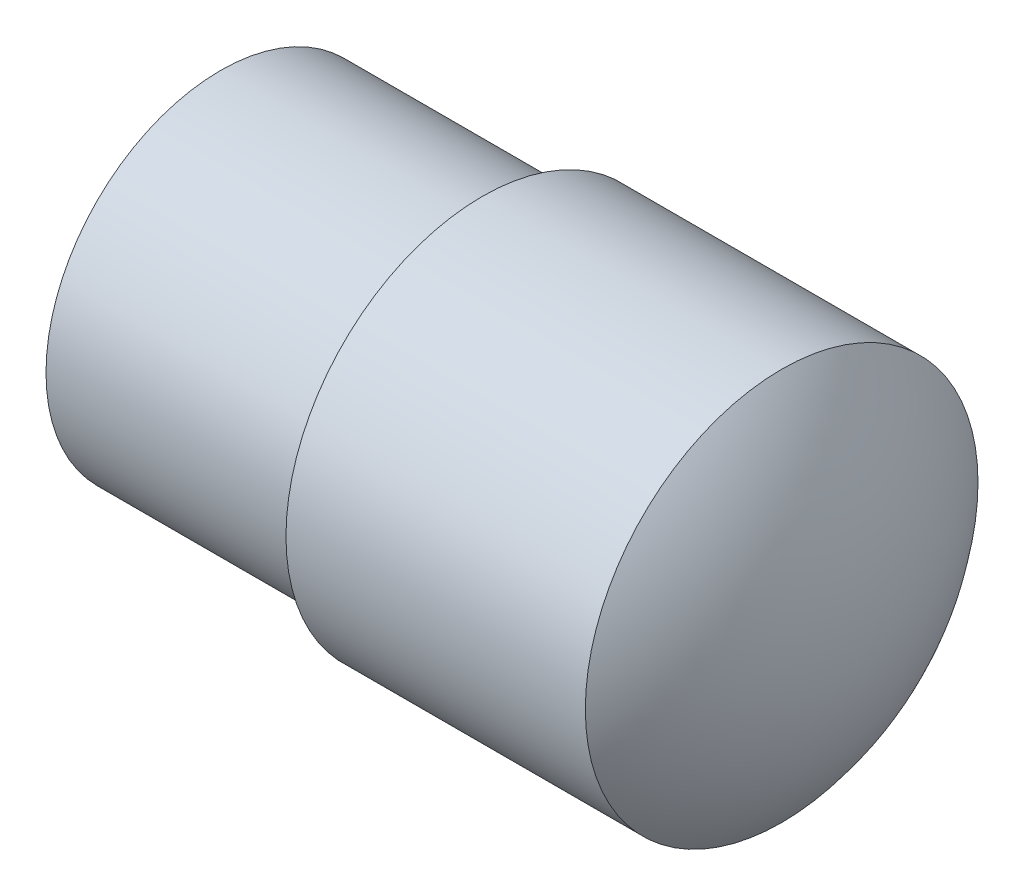
ISO-10303-21;
HEADER;
FILE_DESCRIPTION(('STEP AP214'),'2;1');
FILE_NAME('part.step','',(''),(''),'','','');
FILE_SCHEMA(('AUTOMOTIVE_DESIGN { 1 0 10303 214 1 1 1 1 }'));
ENDSEC;
DATA;
#1=APPLICATION_CONTEXT('core data for automotive mechanical design processes');
#2=APPLICATION_PROTOCOL_DEFINITION('international standard','automotive_design',2000,#1);
#3=PRODUCT_CONTEXT('',#1,'mechanical');
#4=PRODUCT('Part','Part','',(#3));
#5=PRODUCT_RELATED_PRODUCT_CATEGORY('part','',(#4));
#6=PRODUCT_DEFINITION_FORMATION('','',#4);
#7=PRODUCT_DEFINITION_CONTEXT('part definition',#1,'design');
#8=PRODUCT_DEFINITION('design','',#6,#7);
#9=PRODUCT_DEFINITION_SHAPE('','',#8);
#10=(LENGTH_UNIT() NAMED_UNIT(*) SI_UNIT(.MILLI.,.METRE.));
#11=(NAMED_UNIT(*) PLANE_ANGLE_UNIT() SI_UNIT($,.RADIAN.));
#12=(NAMED_UNIT(*) SI_UNIT($,.STERADIAN.) SOLID_ANGLE_UNIT());
#13=UNCERTAINTY_MEASURE_WITH_UNIT(LENGTH_MEASURE(1.E-05),#10,'distance_accuracy_value','');
#14=(GEOMETRIC_REPRESENTATION_CONTEXT(3) GLOBAL_UNCERTAINTY_ASSIGNED_CONTEXT((#13)) GLOBAL_UNIT_ASSIGNED_CONTEXT((#10,
#11,#12)) REPRESENTATION_CONTEXT('',''));
#15=CARTESIAN_POINT('',(0.,0.,0.));
#16=DIRECTION('',(0.,0.,1.));
#17=DIRECTION('',(1.,0.,0.));
#18=AXIS2_PLACEMENT_3D('',#15,#16,#17);
#19=CARTESIAN_POINT('',(-129.4123922426,0.,0.));
#20=DIRECTION('',(-1.,0.,0.));
#21=DIRECTION('',(0.,0.,1.));
#22=AXIS2_PLACEMENT_3D('',#19,#20,#21);
#23=CYLINDRICAL_SURFACE('',#22,9.00000000000001);
#24=CARTESIAN_POINT('',(-103.688586947836,0.,0.));
#25=DIRECTION('',(-1.,0.,0.));
#26=DIRECTION('',(0.,0.,1.));
#27=AXIS2_PLACEMENT_3D('',#24,#25,#26);
#28=CIRCLE('',#27,9.00000000000001);
#29=CARTESIAN_POINT('',(-103.688586947836,0.,9.00000000000001));
#30=VERTEX_POINT('',#29);
#31=EDGE_CURVE('E10',#30,#30,#28,.T.);
#32=ORIENTED_EDGE('',*,*,#31,.T.);
#33=EDGE_LOOP('',(#32));
#34=FACE_BOUND('',#33,.T.);
#35=CARTESIAN_POINT('',(-117.4123922426,0.,0.));
#36=DIRECTION('',(-1.,0.,0.));
#37=DIRECTION('',(0.,0.,1.));
#38=AXIS2_PLACEMENT_3D('',#35,#36,#37);
#39=CIRCLE('',#38,9.00000000000001);
#40=CARTESIAN_POINT('',(-117.4123922426,0.,9.00000000000001));
#41=VERTEX_POINT('',#40);
#42=EDGE_CURVE('E42',#41,#41,#39,.T.);
#43=ORIENTED_EDGE('',*,*,#42,.F.);
#44=EDGE_LOOP('',(#43));
#45=FACE_BOUND('',#44,.T.);
#46=CARTESIAN_POINT('',(-109.4123922426,-8.48528137423858,3.));
#47=CARTESIAN_POINT('',(-109.575796767108,-8.48528083591303,3.00000077384313));
#48=CARTESIAN_POINT('',(-109.739196642071,-8.49005307872573,2.98660435105656));
#49=CARTESIAN_POINT('',(-110.061155505583,-8.50852722243765,2.93355339506642));
#50=CARTESIAN_POINT('',(-110.219713692217,-8.52223059426567,2.89389453650519));
#51=CARTESIAN_POINT('',(-110.527272921592,-8.55684611066376,2.78986645705471));
#52=CARTESIAN_POINT('',(-110.676292030928,-8.57774411913966,2.72554566420973));
#53=CARTESIAN_POINT('',(-110.961472388244,-8.62437366030975,2.57418488532413));
#54=CARTESIAN_POINT('',(-111.097630790261,-8.65010625910838,2.48713988658054));
#55=CARTESIAN_POINT('',(-111.358552129615,-8.7046346822242,2.28915343932863));
#56=CARTESIAN_POINT('',(-111.482738528615,-8.73350684533933,2.17747302413375));
#57=CARTESIAN_POINT('',(-111.711012646274,-8.7904159440301,1.93496300164318));
#58=CARTESIAN_POINT('',(-111.815097137347,-8.81845274486886,1.80413032515712));
#59=CARTESIAN_POINT('',(-112.002828934589,-8.87141600765398,1.52281352389503));
#60=CARTESIAN_POINT('',(-112.085872154454,-8.89624223104817,1.37190573367357));
#61=CARTESIAN_POINT('',(-112.225166997982,-8.93908760312949,1.05729366896242));
#62=CARTESIAN_POINT('',(-112.28142584213,-8.95710858609007,0.89359285706163));
#63=CARTESIAN_POINT('',(-112.363599806497,-8.98377226295721,0.564086452300477));
#64=CARTESIAN_POINT('',(-112.390502581371,-8.99271944332678,0.398552264558902));
#65=CARTESIAN_POINT('',(-112.416341122682,-9.00130824654744,0.0650936244722683));
#66=CARTESIAN_POINT('',(-112.415284097557,-9.00095226788687,-0.102830200631688));
#67=CARTESIAN_POINT('',(-112.385859478902,-8.99118118856195,-0.429310545581442));
#68=CARTESIAN_POINT('',(-112.358564657176,-8.98212194265353,-0.587976145774968));
#69=CARTESIAN_POINT('',(-112.279213299658,-8.95640902019196,-0.898330316466513));
#70=CARTESIAN_POINT('',(-112.22715508566,-8.93975482893546,-1.05001841333765));
#71=CARTESIAN_POINT('',(-112.099128290682,-8.90027010879673,-1.34445742452592));
#72=CARTESIAN_POINT('',(-112.02285442696,-8.87736127572047,-1.48706466290654));
#73=CARTESIAN_POINT('',(-111.848813126254,-8.82775179116758,-1.75777297658197));
#74=CARTESIAN_POINT('',(-111.751039712617,-8.80105008604401,-1.88587000315602));
#75=CARTESIAN_POINT('',(-111.531369062221,-8.74518575549691,-2.13030259965392));
#76=CARTESIAN_POINT('',(-111.408552769075,-8.71596645506634,-2.24580047119581));
#77=CARTESIAN_POINT('',(-111.14504606542,-8.65942005746703,-2.45483177879452));
#78=CARTESIAN_POINT('',(-111.004352905416,-8.63209325236847,-2.54836182984463));
#79=CARTESIAN_POINT('',(-110.706431365789,-8.58211575363338,-2.71196236510723));
#80=CARTESIAN_POINT('',(-110.548995848646,-8.55953727854244,-2.78167939086402));
#81=CARTESIAN_POINT('',(-110.223678059956,-8.52244952473155,-2.89332957980801));
#82=CARTESIAN_POINT('',(-110.055800198981,-8.50793686461279,-2.93527438724248));
#83=CARTESIAN_POINT('',(-109.722477176365,-8.48938908946756,-2.98848384629256));
#84=CARTESIAN_POINT('',(-109.557263968354,-8.48491080956269,-3.00104728652289));
#85=CARTESIAN_POINT('',(-109.227063795257,-8.48570016177554,-2.99881631672915));
#86=CARTESIAN_POINT('',(-109.062076794528,-8.49096602375444,-2.98402687568028));
#87=CARTESIAN_POINT('',(-108.742921345464,-8.51020854270899,-2.92867695465693));
#88=CARTESIAN_POINT('',(-108.588575952147,-8.52387976322522,-2.88901918194205));
#89=CARTESIAN_POINT('',(-108.288761423882,-8.5580566101307,-2.7861415876814));
#90=CARTESIAN_POINT('',(-108.143293867827,-8.57856344804519,-2.72291758909026));
#91=CARTESIAN_POINT('',(-107.860250980059,-8.62490632787362,-2.5724230222168));
#92=CARTESIAN_POINT('',(-107.723072314674,-8.65089076996886,-2.48445335507548));
#93=CARTESIAN_POINT('',(-107.464954085449,-8.70497306192897,-2.28775689167267));
#94=CARTESIAN_POINT('',(-107.344019326616,-8.73307153331384,-2.17902397649634));
#95=CARTESIAN_POINT('',(-107.115808290328,-8.78985115913548,-1.93767511770098));
#96=CARTESIAN_POINT('',(-107.009469072543,-8.8184953073369,-1.80416181163996));
#97=CARTESIAN_POINT('',(-106.820643815556,-8.87180554839327,-1.52048187420077));
#98=CARTESIAN_POINT('',(-106.738156929112,-8.89647178253085,-1.37031583459365));
#99=CARTESIAN_POINT('',(-106.600131928015,-8.9389321743181,-1.05833958729688));
#100=CARTESIAN_POINT('',(-106.544418411156,-8.95677090013594,-0.896613369963583));
#101=CARTESIAN_POINT('',(-106.461209016419,-8.98375832513324,-0.565375397538044));
#102=CARTESIAN_POINT('',(-106.433702952958,-8.99291016102057,-0.395866475861664));
#103=CARTESIAN_POINT('',(-106.408606009783,-9.0012558970877,-0.0624460075801202));
#104=CARTESIAN_POINT('',(-106.409669880803,-9.00089760268318,0.101354171760058));
#105=CARTESIAN_POINT('',(-106.438364167039,-8.99136589558194,0.426333435000524));
#106=CARTESIAN_POINT('',(-106.465992427058,-8.98219319800728,0.587512730457172));
#107=CARTESIAN_POINT('',(-106.546138946328,-8.95622744863238,0.900126358296178));
#108=CARTESIAN_POINT('',(-106.598254888659,-8.93955775083447,1.05167481273837));
#109=CARTESIAN_POINT('',(-106.725524835891,-8.90031482113486,1.34393505281939));
#110=CARTESIAN_POINT('',(-106.800683008191,-8.8777405214405,1.4846448724273));
#111=CARTESIAN_POINT('',(-106.975100778906,-8.82797606483643,1.75690204892636));
#112=CARTESIAN_POINT('',(-107.075148298745,-8.80064617475781,1.88791875467282));
#113=CARTESIAN_POINT('',(-107.295164416068,-8.7447896637564,2.13174307881728));
#114=CARTESIAN_POINT('',(-107.415139369388,-8.71626266319292,2.24454486487378));
#115=CARTESIAN_POINT('',(-107.677220309361,-8.65989839476795,2.45322542649935));
#116=CARTESIAN_POINT('',(-107.82000877553,-8.63213183965893,2.5482688979937));
#117=CARTESIAN_POINT('',(-108.120395523308,-8.58180579969047,2.71294302990334));
#118=CARTESIAN_POINT('',(-108.277989921689,-8.55924495483749,2.78258033045842));
#119=CARTESIAN_POINT('',(-108.596277714647,-8.52304002619545,2.8915314846125));
#120=CARTESIAN_POINT('',(-108.756509033176,-8.50903898571548,2.93207372744856));
#121=CARTESIAN_POINT('',(-109.081960394,-8.49016150618556,2.9863029604478));
#122=CARTESIAN_POINT('',(-109.247178694832,-8.48528191852384,2.99999921758977));
#123=CARTESIAN_POINT('',(-109.4123922426,-8.48528137423858,3.));
#124=B_SPLINE_CURVE_WITH_KNOTS('',3,(#46,#47,#48,#49,#50,#51,#52,#53,#54,#55,#56,#57,#58,#59,
#60,#61,#62,#63,#64,#65,#66,#67,#68,#69,#70,#71,#72,#73,#74,#75,#76,#77,#78,#79,#80,#81,#82,#83,
#84,#85,#86,#87,#88,#89,#90,#91,#92,#93,#94,#95,#96,#97,#98,#99,#100,#101,#102,#103,#104,#105,
#106,#107,#108,#109,#110,#111,#112,#113,#114,#115,#116,#117,#118,#119,#120,#121,#122,#123),
.UNSPECIFIED.,.T.,.F.,(4,2,2,2,2,2,2,2,2,2,2,2,2,2,2,2,2,2,2,2,2,2,2,2,2,2,2,2,2,2,2,2,2,2,2,2,
2,2,4),(0.,0.489601754398076,0.979284165045492,1.46800988250249,1.95684349855633,
2.46304012282704,2.96931795515963,3.48880518430971,4.00815229160367,4.50942956294802,
5.01057759906981,5.49207014476706,5.97359532567709,6.46144964581004,6.94943975622065,
7.46040523091751,7.97144938836316,8.48977919529165,9.00789154069847,9.50262874093319,
9.997276075117,10.4749318730633,10.9526723744084,11.4455657320714,11.9386045698638,
12.4553642451328,12.972105562726,13.4854137357255,13.9985364901247,14.487542540329,
14.9765089202934,15.4577086812129,15.9389955228973,16.438065585619,16.9372951329789,
17.4560670820843,17.974703348006,18.4698963648807,18.9649184157139),.UNSPECIFIED.);
#125=CARTESIAN_POINT('',(-109.4123922426,-8.48528137423858,3.));
#126=VERTEX_POINT('',#125);
#127=EDGE_CURVE('E35',#126,#126,#124,.T.);
#128=ORIENTED_EDGE('',*,*,#127,.F.);
#129=EDGE_LOOP('',(#128));
#130=FACE_BOUND('',#129,.T.);
#131=ADVANCED_FACE('F31',(#34,#45,#130),#23,.T.);
#132=CARTESIAN_POINT('',(-114.4123922426,0.,0.));
#133=DIRECTION('',(-1.,0.,0.));
#134=DIRECTION('',(0.,1.,0.));
#135=AXIS2_PLACEMENT_3D('',#132,#133,#134);
#136=SPHERICAL_SURFACE('',#135,14.);
#137=ORIENTED_EDGE('',*,*,#31,.F.);
#138=EDGE_LOOP('',(#137));
#139=FACE_BOUND('',#138,.T.);
#140=ADVANCED_FACE('F33',(#139),#136,.T.);
#141=CARTESIAN_POINT('',(-117.4123922426,9.00000000000001,0.));
#142=DIRECTION('',(1.,0.,0.));
#143=DIRECTION('',(0.,0.,-1.));
#144=AXIS2_PLACEMENT_3D('',#141,#142,#143);
#145=PLANE('',#144);
#146=CARTESIAN_POINT('',(-117.4123922426,0.,0.));
#147=DIRECTION('',(-1.,0.,0.));
#148=DIRECTION('',(0.,0.,1.));
#149=AXIS2_PLACEMENT_3D('',#146,#147,#148);
#150=CIRCLE('',#149,8.);
#151=CARTESIAN_POINT('',(-117.4123922426,0.,8.));
#152=VERTEX_POINT('',#151);
#153=EDGE_CURVE('E46',#152,#152,#150,.T.);
#154=ORIENTED_EDGE('',*,*,#153,.F.);
#155=EDGE_LOOP('',(#154));
#156=FACE_BOUND('',#155,.T.);
#157=ORIENTED_EDGE('',*,*,#42,.T.);
#158=EDGE_LOOP('',(#157));
#159=FACE_BOUND('',#158,.T.);
#160=ADVANCED_FACE('F67',(#156,#159),#145,.F.);
#161=CARTESIAN_POINT('',(-129.4123922426,0.,0.));
#162=DIRECTION('',(-1.,0.,0.));
#163=DIRECTION('',(0.,0.,1.));
#164=AXIS2_PLACEMENT_3D('',#161,#162,#163);
#165=CYLINDRICAL_SURFACE('',#164,8.);
#166=CARTESIAN_POINT('',(-129.4123922426,0.,0.));
#167=DIRECTION('',(-1.,0.,0.));
#168=DIRECTION('',(0.,0.,1.));
#169=AXIS2_PLACEMENT_3D('',#166,#167,#168);
#170=CIRCLE('',#169,8.);
#171=CARTESIAN_POINT('',(-129.4123922426,0.,8.));
#172=VERTEX_POINT('',#171);
#173=EDGE_CURVE('E51',#172,#172,#170,.T.);
#174=ORIENTED_EDGE('',*,*,#173,.F.);
#175=EDGE_LOOP('',(#174));
#176=FACE_BOUND('',#175,.T.);
#177=ORIENTED_EDGE('',*,*,#153,.T.);
#178=EDGE_LOOP('',(#177));
#179=FACE_BOUND('',#178,.T.);
#180=ADVANCED_FACE('F74',(#176,#179),#165,.T.);
#181=CARTESIAN_POINT('',(-129.4123922426,8.,0.));
#182=DIRECTION('',(1.,0.,0.));
#183=DIRECTION('',(0.,0.,-1.));
#184=AXIS2_PLACEMENT_3D('',#181,#182,#183);
#185=PLANE('',#184);
#186=ORIENTED_EDGE('',*,*,#173,.T.);
#187=EDGE_LOOP('',(#186));
#188=FACE_BOUND('',#187,.T.);
#189=ADVANCED_FACE('F78',(#188),#185,.F.);
#190=CARTESIAN_POINT('',(-109.4123922426,10.6894251531173,0.));
#191=DIRECTION('',(0.,1.,0.));
#192=DIRECTION('',(0.,0.,1.));
#193=AXIS2_PLACEMENT_3D('',#190,#191,#192);
#194=CYLINDRICAL_SURFACE('',#193,3.);
#195=CARTESIAN_POINT('',(-109.4123922426,0.,0.));
#196=DIRECTION('',(0.,1.,0.));
#197=DIRECTION('',(0.,0.,1.));
#198=AXIS2_PLACEMENT_3D('',#195,#196,#197);
#199=CIRCLE('',#198,2.99999999999999);
#200=CARTESIAN_POINT('',(-109.4123922426,0.,2.99999999999999));
#201=VERTEX_POINT('',#200);
#202=EDGE_CURVE('E54',#201,#201,#199,.T.);
#203=ORIENTED_EDGE('',*,*,#202,.T.);
#204=EDGE_LOOP('',(#203));
#205=FACE_BOUND('',#204,.T.);
#206=ORIENTED_EDGE('',*,*,#127,.T.);
#207=EDGE_LOOP('',(#206));
#208=FACE_BOUND('',#207,.T.);
#209=ADVANCED_FACE('F61',(#205,#208),#194,.F.);
#210=CARTESIAN_POINT('',(-109.4123922426,0.,0.));
#211=DIRECTION('',(0.,1.,0.));
#212=DIRECTION('',(1.,0.,0.));
#213=AXIS2_PLACEMENT_3D('',#210,#211,#212);
#214=SPHERICAL_SURFACE('',#213,3.);
#215=ORIENTED_EDGE('',*,*,#202,.F.);
#216=EDGE_LOOP('',(#215));
#217=FACE_BOUND('',#216,.T.);
#218=ADVANCED_FACE('F85',(#217),#214,.F.);
#219=CLOSED_SHELL('',(#131,#140,#160,#180,#189,#209,#218));
#220=MANIFOLD_SOLID_BREP('B2',#219);
#221=ADVANCED_BREP_SHAPE_REPRESENTATION('',(#18,#220),#14);
#222=SHAPE_DEFINITION_REPRESENTATION(#9,#221);
ENDSEC;
END-ISO-10303-21;
